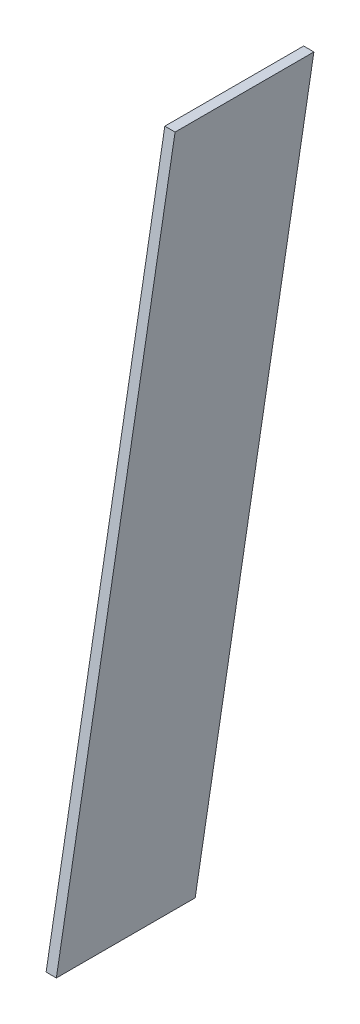
ISO-10303-21;
HEADER;
FILE_DESCRIPTION(('STEP AP214'),'2;1');
FILE_NAME('part.step','',(''),(''),'','','');
FILE_SCHEMA(('AUTOMOTIVE_DESIGN { 1 0 10303 214 1 1 1 1 }'));
ENDSEC;
DATA;
#1=APPLICATION_CONTEXT('core data for automotive mechanical design processes');
#2=APPLICATION_PROTOCOL_DEFINITION('international standard','automotive_design',2000,#1);
#3=PRODUCT_CONTEXT('',#1,'mechanical');
#4=PRODUCT('Part','Part','',(#3));
#5=PRODUCT_RELATED_PRODUCT_CATEGORY('part','',(#4));
#6=PRODUCT_DEFINITION_FORMATION('','',#4);
#7=PRODUCT_DEFINITION_CONTEXT('part definition',#1,'design');
#8=PRODUCT_DEFINITION('design','',#6,#7);
#9=PRODUCT_DEFINITION_SHAPE('','',#8);
#10=(LENGTH_UNIT() NAMED_UNIT(*) SI_UNIT(.MILLI.,.METRE.));
#11=(NAMED_UNIT(*) PLANE_ANGLE_UNIT() SI_UNIT($,.RADIAN.));
#12=(NAMED_UNIT(*) SI_UNIT($,.STERADIAN.) SOLID_ANGLE_UNIT());
#13=UNCERTAINTY_MEASURE_WITH_UNIT(LENGTH_MEASURE(1.E-05),#10,'distance_accuracy_value','');
#14=(GEOMETRIC_REPRESENTATION_CONTEXT(3) GLOBAL_UNCERTAINTY_ASSIGNED_CONTEXT((#13)) GLOBAL_UNIT_ASSIGNED_CONTEXT((#10,
#11,#12)) REPRESENTATION_CONTEXT('',''));
#15=CARTESIAN_POINT('',(0.,0.,0.));
#16=DIRECTION('',(0.,0.,1.));
#17=DIRECTION('',(1.,0.,0.));
#18=AXIS2_PLACEMENT_3D('',#15,#16,#17);
#19=CARTESIAN_POINT('',(15.,456.,406.170644754298));
#20=DIRECTION('',(0.,-1.,0.));
#21=DIRECTION('',(0.,0.,-1.));
#22=AXIS2_PLACEMENT_3D('',#19,#20,#21);
#23=PLANE('',#22);
#24=DIRECTION('',(0.,0.,1.));
#25=VECTOR('',#24,1.);
#26=CARTESIAN_POINT('',(-15.,456.,406.170644754298));
#27=LINE('',#26,#25);
#28=CARTESIAN_POINT('',(-15.,456.,0.));
#29=VERTEX_POINT('',#28);
#30=CARTESIAN_POINT('',(-15.,456.,406.170644754298));
#31=VERTEX_POINT('',#30);
#32=EDGE_CURVE('E102',#29,#31,#27,.T.);
#33=ORIENTED_EDGE('',*,*,#32,.T.);
#34=DIRECTION('',(-1.,0.,0.));
#35=VECTOR('',#34,1.);
#36=CARTESIAN_POINT('',(15.,456.,406.170644754298));
#37=LINE('',#36,#35);
#38=CARTESIAN_POINT('',(15.,456.,406.170644754298));
#39=VERTEX_POINT('',#38);
#40=EDGE_CURVE('E11',#39,#31,#37,.T.);
#41=ORIENTED_EDGE('',*,*,#40,.F.);
#42=DIRECTION('',(0.,0.,1.));
#43=VECTOR('',#42,1.);
#44=CARTESIAN_POINT('',(15.,456.,406.170644754298));
#45=LINE('',#44,#43);
#46=CARTESIAN_POINT('',(15.,456.,0.));
#47=VERTEX_POINT('',#46);
#48=EDGE_CURVE('E90',#47,#39,#45,.T.);
#49=ORIENTED_EDGE('',*,*,#48,.F.);
#50=DIRECTION('',(-1.,0.,0.));
#51=VECTOR('',#50,1.);
#52=CARTESIAN_POINT('',(15.,456.,0.));
#53=LINE('',#52,#51);
#54=EDGE_CURVE('E98',#47,#29,#53,.T.);
#55=ORIENTED_EDGE('',*,*,#54,.T.);
#56=EDGE_LOOP('',(#33,#41,#49,#55));
#57=FACE_BOUND('',#56,.T.);
#58=ADVANCED_FACE('F39',(#57),#23,.F.);
#59=CARTESIAN_POINT('',(15.,-1513.61550602442,753.467000088144));
#60=DIRECTION('',(0.,-0.173648177666923,-0.984807753012209));
#61=DIRECTION('',(0.,0.984807753012209,-0.173648177666923));
#62=AXIS2_PLACEMENT_3D('',#59,#60,#61);
#63=PLANE('',#62);
#64=DIRECTION('',(0.,-0.984807753012209,0.173648177666923));
#65=VECTOR('',#64,1.);
#66=CARTESIAN_POINT('',(-15.,-1513.61550602442,753.467000088144));
#67=LINE('',#66,#65);
#68=CARTESIAN_POINT('',(-15.,-1513.61550602442,753.467000088144));
#69=VERTEX_POINT('',#68);
#70=EDGE_CURVE('E94',#31,#69,#67,.T.);
#71=ORIENTED_EDGE('',*,*,#70,.T.);
#72=DIRECTION('',(-1.,0.,0.));
#73=VECTOR('',#72,1.);
#74=CARTESIAN_POINT('',(15.,-1513.61550602442,753.467000088144));
#75=LINE('',#74,#73);
#76=CARTESIAN_POINT('',(15.,-1513.61550602442,753.467000088144));
#77=VERTEX_POINT('',#76);
#78=EDGE_CURVE('E47',#77,#69,#75,.T.);
#79=ORIENTED_EDGE('',*,*,#78,.F.);
#80=DIRECTION('',(0.,-0.984807753012209,0.173648177666923));
#81=VECTOR('',#80,1.);
#82=CARTESIAN_POINT('',(15.,-1513.61550602442,753.467000088144));
#83=LINE('',#82,#81);
#84=EDGE_CURVE('E85',#39,#77,#83,.T.);
#85=ORIENTED_EDGE('',*,*,#84,.F.);
#86=ORIENTED_EDGE('',*,*,#40,.T.);
#87=EDGE_LOOP('',(#71,#79,#85,#86));
#88=FACE_BOUND('',#87,.T.);
#89=ADVANCED_FACE('F93',(#88),#63,.F.);
#90=CARTESIAN_POINT('',(15.,-1513.61550602442,347.296355333847));
#91=DIRECTION('',(0.,1.,0.));
#92=DIRECTION('',(0.,0.,1.));
#93=AXIS2_PLACEMENT_3D('',#90,#91,#92);
#94=PLANE('',#93);
#95=DIRECTION('',(0.,0.,-1.));
#96=VECTOR('',#95,1.);
#97=CARTESIAN_POINT('',(-15.,-1513.61550602442,347.296355333847));
#98=LINE('',#97,#96);
#99=CARTESIAN_POINT('',(-15.,-1513.61550602442,347.296355333847));
#100=VERTEX_POINT('',#99);
#101=EDGE_CURVE('E72',#69,#100,#98,.T.);
#102=ORIENTED_EDGE('',*,*,#101,.T.);
#103=DIRECTION('',(-1.,0.,0.));
#104=VECTOR('',#103,1.);
#105=CARTESIAN_POINT('',(15.,-1513.61550602442,347.296355333847));
#106=LINE('',#105,#104);
#107=CARTESIAN_POINT('',(15.,-1513.61550602442,347.296355333847));
#108=VERTEX_POINT('',#107);
#109=EDGE_CURVE('E95',#108,#100,#106,.T.);
#110=ORIENTED_EDGE('',*,*,#109,.F.);
#111=DIRECTION('',(0.,0.,-1.));
#112=VECTOR('',#111,1.);
#113=CARTESIAN_POINT('',(15.,-1513.61550602442,347.296355333847));
#114=LINE('',#113,#112);
#115=EDGE_CURVE('E88',#77,#108,#114,.T.);
#116=ORIENTED_EDGE('',*,*,#115,.F.);
#117=ORIENTED_EDGE('',*,*,#78,.T.);
#118=EDGE_LOOP('',(#102,#110,#116,#117));
#119=FACE_BOUND('',#118,.T.);
#120=ADVANCED_FACE('F96',(#119),#94,.F.);
#121=CARTESIAN_POINT('',(15.,456.,0.));
#122=DIRECTION('',(0.,0.173648177666924,0.984807753012209));
#123=DIRECTION('',(0.,-0.984807753012209,0.173648177666924));
#124=AXIS2_PLACEMENT_3D('',#121,#122,#123);
#125=PLANE('',#124);
#126=DIRECTION('',(0.,0.984807753012209,-0.173648177666923));
#127=VECTOR('',#126,1.);
#128=CARTESIAN_POINT('',(-15.,456.,0.));
#129=LINE('',#128,#127);
#130=EDGE_CURVE('E78',#100,#29,#129,.T.);
#131=ORIENTED_EDGE('',*,*,#130,.T.);
#132=ORIENTED_EDGE('',*,*,#54,.F.);
#133=DIRECTION('',(0.,0.984807753012209,-0.173648177666923));
#134=VECTOR('',#133,1.);
#135=CARTESIAN_POINT('',(15.,456.,0.));
#136=LINE('',#135,#134);
#137=EDGE_CURVE('E55',#108,#47,#136,.T.);
#138=ORIENTED_EDGE('',*,*,#137,.F.);
#139=ORIENTED_EDGE('',*,*,#109,.T.);
#140=EDGE_LOOP('',(#131,#132,#138,#139));
#141=FACE_BOUND('',#140,.T.);
#142=ADVANCED_FACE('F109',(#141),#125,.F.);
#143=CARTESIAN_POINT('',(15.,0.,0.));
#144=DIRECTION('',(-1.,0.,0.));
#145=DIRECTION('',(0.,0.,1.));
#146=AXIS2_PLACEMENT_3D('',#143,#144,#145);
#147=PLANE('',#146);
#148=ORIENTED_EDGE('',*,*,#48,.T.);
#149=ORIENTED_EDGE('',*,*,#84,.T.);
#150=ORIENTED_EDGE('',*,*,#115,.T.);
#151=ORIENTED_EDGE('',*,*,#137,.T.);
#152=EDGE_LOOP('',(#148,#149,#150,#151));
#153=FACE_BOUND('',#152,.T.);
#154=ADVANCED_FACE('F86',(#153),#147,.F.);
#155=CARTESIAN_POINT('',(-15.,0.,0.));
#156=DIRECTION('',(-1.,0.,0.));
#157=DIRECTION('',(0.,0.,1.));
#158=AXIS2_PLACEMENT_3D('',#155,#156,#157);
#159=PLANE('',#158);
#160=ORIENTED_EDGE('',*,*,#32,.F.);
#161=ORIENTED_EDGE('',*,*,#130,.F.);
#162=ORIENTED_EDGE('',*,*,#101,.F.);
#163=ORIENTED_EDGE('',*,*,#70,.F.);
#164=EDGE_LOOP('',(#160,#161,#162,#163));
#165=FACE_BOUND('',#164,.T.);
#166=ADVANCED_FACE('F112',(#165),#159,.T.);
#167=CLOSED_SHELL('',(#58,#89,#120,#142,#154,#166));
#168=MANIFOLD_SOLID_BREP('B2',#167);
#169=ADVANCED_BREP_SHAPE_REPRESENTATION('',(#18,#168),#14);
#170=SHAPE_DEFINITION_REPRESENTATION(#9,#169);
ENDSEC;
END-ISO-10303-21;
